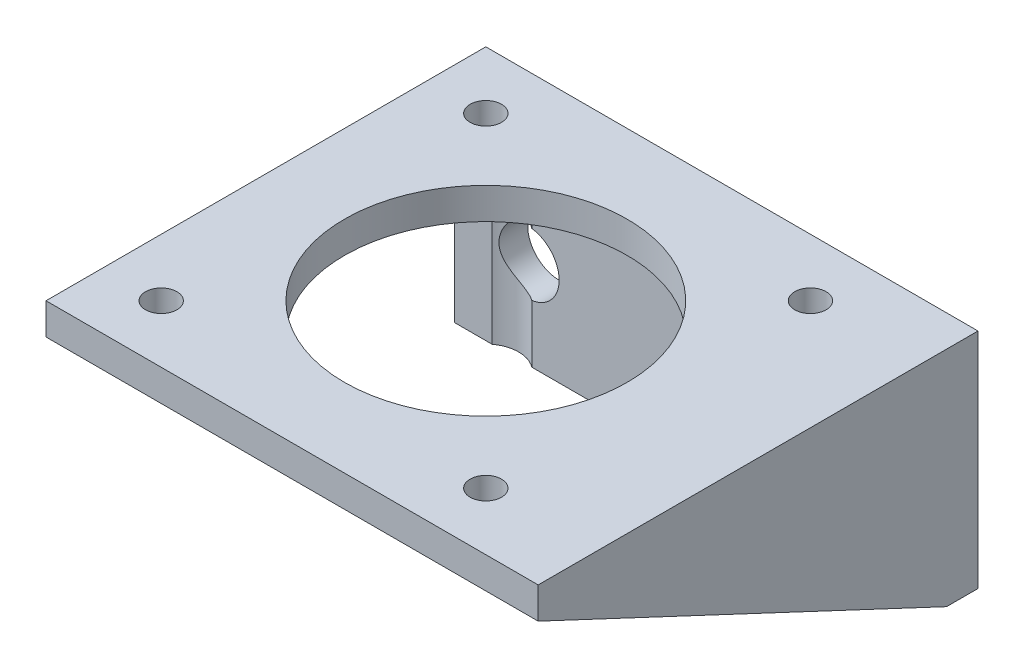
ISO-10303-21;
HEADER;
FILE_DESCRIPTION(('STEP AP214'),'2;1');
FILE_NAME('part.step','',(''),(''),'','','');
FILE_SCHEMA(('AUTOMOTIVE_DESIGN { 1 0 10303 214 1 1 1 1 }'));
ENDSEC;
DATA;
#1=APPLICATION_CONTEXT('core data for automotive mechanical design processes');
#2=APPLICATION_PROTOCOL_DEFINITION('international standard','automotive_design',2000,#1);
#3=PRODUCT_CONTEXT('',#1,'mechanical');
#4=PRODUCT('Part','Part','',(#3));
#5=PRODUCT_RELATED_PRODUCT_CATEGORY('part','',(#4));
#6=PRODUCT_DEFINITION_FORMATION('','',#4);
#7=PRODUCT_DEFINITION_CONTEXT('part definition',#1,'design');
#8=PRODUCT_DEFINITION('design','',#6,#7);
#9=PRODUCT_DEFINITION_SHAPE('','',#8);
#10=(LENGTH_UNIT() NAMED_UNIT(*) SI_UNIT(.MILLI.,.METRE.));
#11=(NAMED_UNIT(*) PLANE_ANGLE_UNIT() SI_UNIT($,.RADIAN.));
#12=(NAMED_UNIT(*) SI_UNIT($,.STERADIAN.) SOLID_ANGLE_UNIT());
#13=UNCERTAINTY_MEASURE_WITH_UNIT(LENGTH_MEASURE(1.E-05),#10,'distance_accuracy_value','');
#14=(GEOMETRIC_REPRESENTATION_CONTEXT(3) GLOBAL_UNCERTAINTY_ASSIGNED_CONTEXT((#13)) GLOBAL_UNIT_ASSIGNED_CONTEXT((#10,
#11,#12)) REPRESENTATION_CONTEXT('',''));
#15=CARTESIAN_POINT('',(0.,0.,0.));
#16=DIRECTION('',(0.,0.,1.));
#17=DIRECTION('',(1.,0.,0.));
#18=AXIS2_PLACEMENT_3D('',#15,#16,#17);
#19=CARTESIAN_POINT('',(77.1447839151503,157.565968794144,3.));
#20=DIRECTION('',(0.,1.,0.));
#21=DIRECTION('',(0.,0.,1.));
#22=AXIS2_PLACEMENT_3D('',#19,#20,#21);
#23=PLANE('',#22);
#24=CARTESIAN_POINT('',(113.64478391515,157.565968794144,5.50017920588967));
#25=DIRECTION('',(0.,1.,0.));
#26=DIRECTION('',(0.,0.,1.));
#27=AXIS2_PLACEMENT_3D('',#24,#25,#26);
#28=CIRCLE('',#27,3.13434940060138);
#29=CARTESIAN_POINT('',(111.754479679455,157.565968794144,3.));
#30=VERTEX_POINT('',#29);
#31=CARTESIAN_POINT('',(115.535088150845,157.565968794144,3.));
#32=VERTEX_POINT('',#31);
#33=EDGE_CURVE('E131',#30,#32,#28,.F.);
#34=ORIENTED_EDGE('',*,*,#33,.F.);
#35=DIRECTION('',(1.,0.,0.));
#36=VECTOR('',#35,1.);
#37=CARTESIAN_POINT('',(77.1447839151503,157.565968794144,3.));
#38=LINE('',#37,#36);
#39=CARTESIAN_POINT('',(84.5350881508455,157.565968794144,3.));
#40=VERTEX_POINT('',#39);
#41=EDGE_CURVE('E329',#40,#30,#38,.T.);
#42=ORIENTED_EDGE('',*,*,#41,.F.);
#43=CARTESIAN_POINT('',(82.6447839151503,157.565968794144,5.50017920588967));
#44=DIRECTION('',(0.,1.,0.));
#45=DIRECTION('',(0.,0.,1.));
#46=AXIS2_PLACEMENT_3D('',#43,#44,#45);
#47=CIRCLE('',#46,3.13434940060138);
#48=CARTESIAN_POINT('',(80.7544796794551,157.565968794144,3.));
#49=VERTEX_POINT('',#48);
#50=EDGE_CURVE('E233',#49,#40,#47,.F.);
#51=ORIENTED_EDGE('',*,*,#50,.F.);
#52=CARTESIAN_POINT('',(77.1447839151503,157.565968794144,3.));
#53=VERTEX_POINT('',#52);
#54=EDGE_CURVE('E332',#53,#49,#38,.T.);
#55=ORIENTED_EDGE('',*,*,#54,.F.);
#56=DIRECTION('',(0.,0.,-1.));
#57=VECTOR('',#56,1.);
#58=CARTESIAN_POINT('',(77.1447839151503,157.565968794144,3.));
#59=LINE('',#58,#57);
#60=CARTESIAN_POINT('',(77.1447839151503,157.565968794144,0.));
#61=VERTEX_POINT('',#60);
#62=EDGE_CURVE('E11',#53,#61,#59,.T.);
#63=ORIENTED_EDGE('',*,*,#62,.T.);
#64=DIRECTION('',(1.,0.,0.));
#65=VECTOR('',#64,1.);
#66=CARTESIAN_POINT('',(77.1447839151503,157.565968794144,0.));
#67=LINE('',#66,#65);
#68=CARTESIAN_POINT('',(124.14478391515,157.565968794144,0.));
#69=VERTEX_POINT('',#68);
#70=EDGE_CURVE('E342',#61,#69,#67,.T.);
#71=ORIENTED_EDGE('',*,*,#70,.T.);
#72=DIRECTION('',(0.,0.,-1.));
#73=VECTOR('',#72,1.);
#74=CARTESIAN_POINT('',(124.14478391515,157.565968794144,3.));
#75=LINE('',#74,#73);
#76=CARTESIAN_POINT('',(124.14478391515,157.565968794144,3.));
#77=VERTEX_POINT('',#76);
#78=EDGE_CURVE('E219',#77,#69,#75,.T.);
#79=ORIENTED_EDGE('',*,*,#78,.F.);
#80=DIRECTION('',(-1.,0.,0.));
#81=VECTOR('',#80,1.);
#82=CARTESIAN_POINT('',(124.14478391515,157.565968794144,3.));
#83=LINE('',#82,#81);
#84=CARTESIAN_POINT('',(119.14478391515,157.565968794144,3.));
#85=VERTEX_POINT('',#84);
#86=EDGE_CURVE('E212',#77,#85,#83,.T.);
#87=ORIENTED_EDGE('',*,*,#86,.T.);
#88=EDGE_CURVE('E330',#32,#85,#38,.T.);
#89=ORIENTED_EDGE('',*,*,#88,.F.);
#90=EDGE_LOOP('',(#34,#42,#51,#55,#63,#71,#79,#87,#89));
#91=FACE_BOUND('',#90,.T.);
#92=ADVANCED_FACE('F33',(#91),#23,.F.);
#93=CARTESIAN_POINT('',(77.1447839151503,178.865968794144,3.));
#94=DIRECTION('',(0.,0.,-1.));
#95=DIRECTION('',(-1.,0.,0.));
#96=AXIS2_PLACEMENT_3D('',#93,#94,#95);
#97=PLANE('',#96);
#98=DIRECTION('',(0.,1.,0.));
#99=VECTOR('',#98,1.);
#100=CARTESIAN_POINT('',(111.754479679455,155.865968794144,3.));
#101=LINE('',#100,#99);
#102=CARTESIAN_POINT('',(111.754479679455,175.865968794144,3.));
#103=VERTEX_POINT('',#102);
#104=CARTESIAN_POINT('',(111.754479679455,169.040470870727,3.));
#105=VERTEX_POINT('',#104);
#106=EDGE_CURVE('E48',#103,#105,#101,.F.);
#107=ORIENTED_EDGE('',*,*,#106,.F.);
#108=DIRECTION('',(-1.,0.,0.));
#109=VECTOR('',#108,1.);
#110=CARTESIAN_POINT('',(77.1447839151503,175.865968794144,3.));
#111=LINE('',#110,#109);
#112=CARTESIAN_POINT('',(84.5350881508455,175.865968794144,3.));
#113=VERTEX_POINT('',#112);
#114=EDGE_CURVE('E145',#103,#113,#111,.T.);
#115=ORIENTED_EDGE('',*,*,#114,.T.);
#116=DIRECTION('',(0.,1.,0.));
#117=VECTOR('',#116,1.);
#118=CARTESIAN_POINT('',(84.5350881508455,155.865968794144,3.));
#119=LINE('',#118,#117);
#120=CARTESIAN_POINT('',(84.5350881508455,169.040470870727,3.));
#121=VERTEX_POINT('',#120);
#122=EDGE_CURVE('E235',#121,#113,#119,.T.);
#123=ORIENTED_EDGE('',*,*,#122,.F.);
#124=CARTESIAN_POINT('',(84.1447839151503,166.065968794144,3.));
#125=DIRECTION('',(0.,0.,1.));
#126=DIRECTION('',(1.,0.,0.));
#127=AXIS2_PLACEMENT_3D('',#124,#125,#126);
#128=CIRCLE('',#127,3.00000000000001);
#129=CARTESIAN_POINT('',(84.5350881508455,163.09146671756,3.));
#130=VERTEX_POINT('',#129);
#131=EDGE_CURVE('E152',#130,#121,#128,.T.);
#132=ORIENTED_EDGE('',*,*,#131,.F.);
#133=EDGE_CURVE('E56',#40,#130,#119,.T.);
#134=ORIENTED_EDGE('',*,*,#133,.F.);
#135=ORIENTED_EDGE('',*,*,#41,.T.);
#136=CARTESIAN_POINT('',(111.754479679455,163.09146671756,3.));
#137=VERTEX_POINT('',#136);
#138=EDGE_CURVE('E321',#137,#30,#101,.F.);
#139=ORIENTED_EDGE('',*,*,#138,.F.);
#140=CARTESIAN_POINT('',(112.14478391515,166.065968794144,3.));
#141=DIRECTION('',(0.,0.,1.));
#142=DIRECTION('',(1.,0.,0.));
#143=AXIS2_PLACEMENT_3D('',#140,#141,#142);
#144=CIRCLE('',#143,3.00000000000001);
#145=EDGE_CURVE('E386',#105,#137,#144,.T.);
#146=ORIENTED_EDGE('',*,*,#145,.F.);
#147=EDGE_LOOP('',(#107,#115,#123,#132,#134,#135,#139,#146));
#148=FACE_BOUND('',#147,.T.);
#149=ADVANCED_FACE('F296',(#148),#97,.F.);
#150=DIRECTION('',(0.,1.,0.));
#151=VECTOR('',#150,1.);
#152=CARTESIAN_POINT('',(115.535088150845,155.865968794144,3.));
#153=LINE('',#152,#151);
#154=CARTESIAN_POINT('',(115.535088150845,175.865968794144,3.));
#155=VERTEX_POINT('',#154);
#156=EDGE_CURVE('E126',#32,#155,#153,.T.);
#157=ORIENTED_EDGE('',*,*,#156,.F.);
#158=ORIENTED_EDGE('',*,*,#88,.T.);
#159=DIRECTION('',(0.,1.,0.));
#160=VECTOR('',#159,1.);
#161=CARTESIAN_POINT('',(119.14478391515,157.565968794144,3.));
#162=LINE('',#161,#160);
#163=CARTESIAN_POINT('',(119.14478391515,175.865968794144,3.));
#164=VERTEX_POINT('',#163);
#165=EDGE_CURVE('E151',#85,#164,#162,.T.);
#166=ORIENTED_EDGE('',*,*,#165,.T.);
#167=EDGE_CURVE('E143',#164,#155,#111,.T.);
#168=ORIENTED_EDGE('',*,*,#167,.T.);
#169=EDGE_LOOP('',(#157,#158,#166,#168));
#170=FACE_BOUND('',#169,.T.);
#171=ADVANCED_FACE('F149',(#170),#97,.F.);
#172=CARTESIAN_POINT('',(112.14478391515,166.065968794144,0.));
#173=DIRECTION('',(0.,0.,1.));
#174=DIRECTION('',(1.,0.,0.));
#175=AXIS2_PLACEMENT_3D('',#172,#173,#174);
#176=CYLINDRICAL_SURFACE('',#175,3.00000000000001);
#177=CARTESIAN_POINT('',(112.14478391515,166.065968794144,0.));
#178=DIRECTION('',(0.,0.,1.));
#179=DIRECTION('',(1.,0.,0.));
#180=AXIS2_PLACEMENT_3D('',#177,#178,#179);
#181=CIRCLE('',#180,3.00000000000001);
#182=CARTESIAN_POINT('',(115.14478391515,166.065968794144,0.));
#183=VERTEX_POINT('',#182);
#184=EDGE_CURVE('E343',#183,#183,#181,.T.);
#185=ORIENTED_EDGE('',*,*,#184,.F.);
#186=EDGE_LOOP('',(#185));
#187=FACE_BOUND('',#186,.T.);
#188=CARTESIAN_POINT('',(111.754479679455,169.040470870727,3.));
#189=CARTESIAN_POINT('',(111.807241165498,169.047398750531,2.96009950952061));
#190=CARTESIAN_POINT('',(111.861392910043,169.053071317085,2.92179186020854));
#191=CARTESIAN_POINT('',(111.972209728457,169.061515830034,2.84856758024539));
#192=CARTESIAN_POINT('',(112.028876510419,169.064285772686,2.81365330718006));
#193=CARTESIAN_POINT('',(112.144491565869,169.06652651169,2.74741436383865));
#194=CARTESIAN_POINT('',(112.203443943069,169.065991072186,2.71609659203178));
#195=CARTESIAN_POINT('',(112.323077566866,169.061265769476,2.65734795097251));
#196=CARTESIAN_POINT('',(112.383758397043,169.057076779399,2.62991615486653));
#197=CARTESIAN_POINT('',(112.568293469794,169.038493022818,2.55348399757745));
#198=CARTESIAN_POINT('',(112.694211691861,169.018068332499,2.51059172224993));
#199=CARTESIAN_POINT('',(112.946338042062,168.959795009431,2.44184771531341));
#200=CARTESIAN_POINT('',(113.072545130703,168.921980327198,2.41596301784283));
#201=CARTESIAN_POINT('',(113.313752898231,168.83168087302,2.38111111928611));
#202=CARTESIAN_POINT('',(113.428984930558,168.780138908747,2.37127571495604));
#203=CARTESIAN_POINT('',(113.652380511964,168.662718198824,2.36384236019069));
#204=CARTESIAN_POINT('',(113.760536753154,168.596824925861,2.36625686551768));
#205=CARTESIAN_POINT('',(113.973417557881,168.447979464264,2.38117062313417));
#206=CARTESIAN_POINT('',(114.077545688311,168.364240304641,2.39426696601608));
#207=CARTESIAN_POINT('',(114.273119895231,168.184425150913,2.42785090056312));
#208=CARTESIAN_POINT('',(114.364561824964,168.088345142608,2.44834090115937));
#209=CARTESIAN_POINT('',(114.548132290552,167.868147199951,2.49707982313188));
#210=CARTESIAN_POINT('',(114.637688725855,167.742046745113,2.52605675051341));
#211=CARTESIAN_POINT('',(114.796518132387,167.477396188589,2.58387653723346));
#212=CARTESIAN_POINT('',(114.865770527551,167.338833642342,2.61271923161886));
#213=CARTESIAN_POINT('',(114.956412424969,167.115796584693,2.65324629721041));
#214=CARTESIAN_POINT('',(114.985388723487,167.034684129988,2.66685548386954));
#215=CARTESIAN_POINT('',(115.036337260104,166.869924582049,2.69152663529153));
#216=CARTESIAN_POINT('',(115.058312640323,166.786278644393,2.70258974215383));
#217=CARTESIAN_POINT('',(115.09498660488,166.617135998744,2.72142335739966));
#218=CARTESIAN_POINT('',(115.109693150865,166.531641423238,2.7291974669133));
#219=CARTESIAN_POINT('',(115.131655602582,166.359442951891,2.74091917376305));
#220=CARTESIAN_POINT('',(115.138912633582,166.272739240698,2.74486734901061));
#221=CARTESIAN_POINT('',(115.145534850417,166.1071602075,2.74846999118184));
#222=CARTESIAN_POINT('',(115.145580995801,166.028319371839,2.74849494842985));
#223=CARTESIAN_POINT('',(115.139472891832,165.870923272253,2.74517226569997));
#224=CARTESIAN_POINT('',(115.133316553268,165.792368113502,2.74182348933225));
#225=CARTESIAN_POINT('',(115.114879378002,165.636183979926,2.73195330083328));
#226=CARTESIAN_POINT('',(115.102598649711,165.558554988732,2.72543194486175));
#227=CARTESIAN_POINT('',(115.072062242318,165.404759622836,2.70960323413091));
#228=CARTESIAN_POINT('',(115.053804098635,165.328593865187,2.70029473032276));
#229=CARTESIAN_POINT('',(114.992014397557,165.109026939155,2.66977408813007));
#230=CARTESIAN_POINT('',(114.940677928397,164.968173938518,2.64548488747308));
#231=CARTESIAN_POINT('',(114.818028003355,164.696269268496,2.59293447094592));
#232=CARTESIAN_POINT('',(114.746698287858,164.565225687041,2.5646700315519));
#233=CARTESIAN_POINT('',(114.575145169646,164.299213063954,2.50554871520531));
#234=CARTESIAN_POINT('',(114.47241785415,164.165818554898,2.47481215810874));
#235=CARTESIAN_POINT('',(114.245091933422,163.917251269634,2.42164860289372));
#236=CARTESIAN_POINT('',(114.120516028573,163.802059814573,2.39921305465066));
#237=CARTESIAN_POINT('',(113.879697801667,163.614765311404,2.37279788837075));
#238=CARTESIAN_POINT('',(113.766882260508,163.538660935271,2.36599962165018));
#239=CARTESIAN_POINT('',(113.531951313608,163.402484827779,2.36566682956812));
#240=CARTESIAN_POINT('',(113.409845377408,163.342397045095,2.37211896817694));
#241=CARTESIAN_POINT('',(113.159607846537,163.239574517229,2.40103944937335));
#242=CARTESIAN_POINT('',(113.031451307497,163.196920174624,2.42358071244523));
#243=CARTESIAN_POINT('',(112.774585341323,163.129819542617,2.48615212522214));
#244=CARTESIAN_POINT('',(112.64587577091,163.105378298697,2.52618711625805));
#245=CARTESIAN_POINT('',(112.402489268516,163.074726743498,2.61979767973562));
#246=CARTESIAN_POINT('',(112.287482161332,163.067291381708,2.67213892861141));
#247=CARTESIAN_POINT('',(112.06469289274,163.064972850779,2.7903220127202));
#248=CARTESIAN_POINT('',(111.95690264721,163.070075386942,2.85614839484385));
#249=CARTESIAN_POINT('',(111.820209829674,163.083384617957,2.95130132977167));
#250=CARTESIAN_POINT('',(111.787071153835,163.087186012692,2.97535085666324));
#251=CARTESIAN_POINT('',(111.754479679455,163.09146671756,3.));
#252=B_SPLINE_CURVE_WITH_KNOTS('',3,(#188,#189,#190,#191,#192,#193,#194,#195,#196,#197,#198,
#199,#200,#201,#202,#203,#204,#205,#206,#207,#208,#209,#210,#211,#212,#213,#214,#215,#216,#217,
#218,#219,#220,#221,#222,#223,#224,#225,#226,#227,#228,#229,#230,#231,#232,#233,#234,#235,#236,
#237,#238,#239,#240,#241,#242,#243,#244,#245,#246,#247,#248,#249,#250,#251),.UNSPECIFIED.,.F.,
.F.,(4,2,2,2,2,2,2,2,2,2,2,2,2,2,2,2,2,2,2,2,2,2,2,2,2,2,2,2,2,2,2,4),(0.,0.199514071354091,
0.399165781034447,0.599194263914631,0.799174956892081,1.20059821554179,1.60124108024834,
1.97939083119544,2.35792516349336,2.75919853062522,3.16060275504447,3.63085226042168,
4.10157668123125,4.36288052878185,4.62406693335047,4.88496661960254,5.14582689053295,
5.38203637473139,5.61832544904167,5.85461034081138,6.0909927794645,6.54464602766998,
6.99866928763445,7.50972273437824,8.02024831566337,8.42732049032134,8.83398316309133,
9.24250074663651,9.65113145773541,10.0292491086296,10.4069358603642,10.530245763783),.UNSPECIFIED.);
#253=EDGE_CURVE('E146',#105,#137,#252,.T.);
#254=ORIENTED_EDGE('',*,*,#253,.F.);
#255=ORIENTED_EDGE('',*,*,#145,.T.);
#256=EDGE_LOOP('',(#254,#255));
#257=FACE_BOUND('',#256,.T.);
#258=ADVANCED_FACE('F312',(#187,#257),#176,.F.);
#259=DIRECTION('',(0.,1.,0.));
#260=VECTOR('',#259,1.);
#261=CARTESIAN_POINT('',(80.7544796794551,155.865968794144,3.));
#262=LINE('',#261,#260);
#263=CARTESIAN_POINT('',(80.7544796794551,175.865968794144,3.));
#264=VERTEX_POINT('',#263);
#265=EDGE_CURVE('E220',#264,#49,#262,.F.);
#266=ORIENTED_EDGE('',*,*,#265,.F.);
#267=CARTESIAN_POINT('',(77.1447839151503,175.865968794144,3.));
#268=VERTEX_POINT('',#267);
#269=EDGE_CURVE('E154',#264,#268,#111,.T.);
#270=ORIENTED_EDGE('',*,*,#269,.T.);
#271=DIRECTION('',(0.,-1.,0.));
#272=VECTOR('',#271,1.);
#273=CARTESIAN_POINT('',(77.1447839151503,157.565968794144,3.));
#274=LINE('',#273,#272);
#275=EDGE_CURVE('E335',#268,#53,#274,.T.);
#276=ORIENTED_EDGE('',*,*,#275,.T.);
#277=ORIENTED_EDGE('',*,*,#54,.T.);
#278=EDGE_LOOP('',(#266,#270,#276,#277));
#279=FACE_BOUND('',#278,.T.);
#280=ADVANCED_FACE('F304',(#279),#97,.F.);
#281=CARTESIAN_POINT('',(84.1447839151503,166.065968794144,0.));
#282=DIRECTION('',(0.,0.,1.));
#283=DIRECTION('',(1.,0.,0.));
#284=AXIS2_PLACEMENT_3D('',#281,#282,#283);
#285=CYLINDRICAL_SURFACE('',#284,3.00000000000001);
#286=CARTESIAN_POINT('',(84.1447839151503,166.065968794144,0.));
#287=DIRECTION('',(0.,0.,1.));
#288=DIRECTION('',(1.,0.,0.));
#289=AXIS2_PLACEMENT_3D('',#286,#287,#288);
#290=CIRCLE('',#289,3.00000000000001);
#291=CARTESIAN_POINT('',(87.1447839151503,166.065968794144,0.));
#292=VERTEX_POINT('',#291);
#293=EDGE_CURVE('E156',#292,#292,#290,.T.);
#294=ORIENTED_EDGE('',*,*,#293,.F.);
#295=EDGE_LOOP('',(#294));
#296=FACE_BOUND('',#295,.T.);
#297=CARTESIAN_POINT('',(84.5350881508455,163.09146671756,3.));
#298=CARTESIAN_POINT('',(84.4823266648026,163.084538837757,2.96009950952061));
#299=CARTESIAN_POINT('',(84.4281749202579,163.078866271203,2.92179186020854));
#300=CARTESIAN_POINT('',(84.317358101844,163.070421758253,2.84856758024539));
#301=CARTESIAN_POINT('',(84.2606913198816,163.067651815602,2.81365330718006));
#302=CARTESIAN_POINT('',(84.1450762644313,163.065411076597,2.74741436383865));
#303=CARTESIAN_POINT('',(84.0861238872312,163.065946516101,2.71609659203178));
#304=CARTESIAN_POINT('',(83.966490263435,163.070671818811,2.65734795097251));
#305=CARTESIAN_POINT('',(83.9058094332577,163.074860808889,2.62991615486653));
#306=CARTESIAN_POINT('',(83.721274360507,163.093444565469,2.55348399757745));
#307=CARTESIAN_POINT('',(83.5953561384393,163.113869255788,2.51059172224993));
#308=CARTESIAN_POINT('',(83.3432297882384,163.172142578856,2.44184771531341));
#309=CARTESIAN_POINT('',(83.2170226995973,163.209957261089,2.41596301784283));
#310=CARTESIAN_POINT('',(82.9758149320699,163.300256715267,2.38111111928611));
#311=CARTESIAN_POINT('',(82.8605828997426,163.351798679541,2.37127571495603));
#312=CARTESIAN_POINT('',(82.6371873183362,163.469219389464,2.36384236019069));
#313=CARTESIAN_POINT('',(82.5290310771467,163.535112662426,2.36625686551768));
#314=CARTESIAN_POINT('',(82.3161502724197,163.683958124023,2.38117062313417));
#315=CARTESIAN_POINT('',(82.2120221419892,163.767697283646,2.39426696601608));
#316=CARTESIAN_POINT('',(82.0164479350698,163.947512437374,2.42785090056312));
#317=CARTESIAN_POINT('',(81.9250060053365,164.043592445679,2.44834090115937));
#318=CARTESIAN_POINT('',(81.7414355397483,164.263790388336,2.49707982313189));
#319=CARTESIAN_POINT('',(81.6518791044454,164.389890843174,2.52605675051342));
#320=CARTESIAN_POINT('',(81.4930496979141,164.654541399698,2.58387653723346));
#321=CARTESIAN_POINT('',(81.4237973027495,164.793103945945,2.61271923161886));
#322=CARTESIAN_POINT('',(81.3331554053317,165.016141003594,2.65324629721042));
#323=CARTESIAN_POINT('',(81.3041791068138,165.097253458299,2.66685548386956));
#324=CARTESIAN_POINT('',(81.253230570197,165.262013006238,2.69152663529155));
#325=CARTESIAN_POINT('',(81.2312551899774,165.345658943894,2.70258974215384));
#326=CARTESIAN_POINT('',(81.1945812254203,165.514801589544,2.72142335739968));
#327=CARTESIAN_POINT('',(81.1798746794356,165.600296165049,2.72919746691332));
#328=CARTESIAN_POINT('',(81.1579122277184,165.772494636396,2.74091917376307));
#329=CARTESIAN_POINT('',(81.150655196719,165.859198347589,2.74486734901062));
#330=CARTESIAN_POINT('',(81.1440329798832,166.024777380787,2.74846999118186));
#331=CARTESIAN_POINT('',(81.1439868344994,166.103618216448,2.74849494842986));
#332=CARTESIAN_POINT('',(81.1500949384687,166.261014316034,2.74517226569999));
#333=CARTESIAN_POINT('',(81.1562512770324,166.339569474785,2.74182348933226));
#334=CARTESIAN_POINT('',(81.1746884522985,166.495753608361,2.73195330083329));
#335=CARTESIAN_POINT('',(81.1869691805895,166.573382599555,2.72543194486176));
#336=CARTESIAN_POINT('',(81.2175055879827,166.727177965451,2.70960323413092));
#337=CARTESIAN_POINT('',(81.2357637316659,166.803343723101,2.70029473032278));
#338=CARTESIAN_POINT('',(81.2975534327439,167.022910649132,2.66977408813009));
#339=CARTESIAN_POINT('',(81.3488899019039,167.163763649769,2.64548488747311));
#340=CARTESIAN_POINT('',(81.4715398269459,167.435668319791,2.59293447094594));
#341=CARTESIAN_POINT('',(81.5428695424428,167.566711901246,2.56467003155192));
#342=CARTESIAN_POINT('',(81.7144226606545,167.832724524333,2.50554871520532));
#343=CARTESIAN_POINT('',(81.8171499761507,167.966119033389,2.47481215810875));
#344=CARTESIAN_POINT('',(82.0444758968785,168.214686318653,2.42164860289373));
#345=CARTESIAN_POINT('',(82.169051801728,168.329877773714,2.39921305465067));
#346=CARTESIAN_POINT('',(82.4098700286332,168.517172276883,2.37279788837075));
#347=CARTESIAN_POINT('',(82.5226855697928,168.593276653016,2.36599962165018));
#348=CARTESIAN_POINT('',(82.7576165166923,168.729452760508,2.36566682956812));
#349=CARTESIAN_POINT('',(82.8797224528926,168.789540543192,2.37211896817694));
#350=CARTESIAN_POINT('',(83.1299599837631,168.892363071059,2.40103944937334));
#351=CARTESIAN_POINT('',(83.2581165228033,168.935017413663,2.42358071244523));
#352=CARTESIAN_POINT('',(83.5149824889773,169.00211804567,2.48615212522213));
#353=CARTESIAN_POINT('',(83.6436920593903,169.02655928959,2.52618711625804));
#354=CARTESIAN_POINT('',(83.8870785617844,169.057210844789,2.61979767973561));
#355=CARTESIAN_POINT('',(84.0020856689681,169.064646206579,2.6721389286114));
#356=CARTESIAN_POINT('',(84.2248749375606,169.066964737508,2.79032201272019));
#357=CARTESIAN_POINT('',(84.3326651830907,169.061862201345,2.85614839484384));
#358=CARTESIAN_POINT('',(84.4693580006267,169.04855297033,2.95130132977166));
#359=CARTESIAN_POINT('',(84.5024966764658,169.044751575596,2.97535085666324));
#360=CARTESIAN_POINT('',(84.5350881508455,169.040470870727,3.));
#361=B_SPLINE_CURVE_WITH_KNOTS('',3,(#297,#298,#299,#300,#301,#302,#303,#304,#305,#306,#307,
#308,#309,#310,#311,#312,#313,#314,#315,#316,#317,#318,#319,#320,#321,#322,#323,#324,#325,#326,
#327,#328,#329,#330,#331,#332,#333,#334,#335,#336,#337,#338,#339,#340,#341,#342,#343,#344,#345,
#346,#347,#348,#349,#350,#351,#352,#353,#354,#355,#356,#357,#358,#359,#360),.UNSPECIFIED.,.F.,
.F.,(4,2,2,2,2,2,2,2,2,2,2,2,2,2,2,2,2,2,2,2,2,2,2,2,2,2,2,2,2,2,2,4),(0.,0.199514071354091,
0.399165781034447,0.599194263914631,0.799174956892081,1.2005982155418,1.60124108024834,
1.97939083119547,2.35792516349335,2.75919853062522,3.16060275504446,3.63085226042168,
4.10157668123124,4.36288052878191,4.6240669333505,4.88496661960259,5.14582689053292,
5.38203637473136,5.6183254490417,5.8546103408114,6.09099277946449,6.54464602766994,
6.99866928763444,7.50972273437824,8.02024831566336,8.42732049032136,8.83398316309135,
9.24250074663654,9.65113145773543,10.0292491086297,10.4069358603643,10.530245763783),.UNSPECIFIED.);
#362=EDGE_CURVE('E238',#130,#121,#361,.T.);
#363=ORIENTED_EDGE('',*,*,#362,.F.);
#364=ORIENTED_EDGE('',*,*,#131,.T.);
#365=EDGE_LOOP('',(#363,#364));
#366=FACE_BOUND('',#365,.T.);
#367=ADVANCED_FACE('F245',(#296,#366),#285,.F.);
#368=CARTESIAN_POINT('',(77.1447839151503,157.565968794144,3.));
#369=DIRECTION('',(1.,0.,0.));
#370=DIRECTION('',(0.,0.,-1.));
#371=AXIS2_PLACEMENT_3D('',#368,#369,#370);
#372=PLANE('',#371);
#373=ORIENTED_EDGE('',*,*,#275,.F.);
#374=DIRECTION('',(0.,0.,1.));
#375=VECTOR('',#374,1.);
#376=CARTESIAN_POINT('',(77.1447839151503,175.865968794144,0.));
#377=LINE('',#376,#375);
#378=CARTESIAN_POINT('',(77.1447839151503,175.865968794144,42.));
#379=VERTEX_POINT('',#378);
#380=EDGE_CURVE('E172',#268,#379,#377,.T.);
#381=ORIENTED_EDGE('',*,*,#380,.T.);
#382=DIRECTION('',(0.,1.,0.));
#383=VECTOR('',#382,1.);
#384=CARTESIAN_POINT('',(77.1447839151503,175.865968794144,42.));
#385=LINE('',#384,#383);
#386=CARTESIAN_POINT('',(77.1447839151503,178.865968794144,42.));
#387=VERTEX_POINT('',#386);
#388=EDGE_CURVE('E160',#379,#387,#385,.T.);
#389=ORIENTED_EDGE('',*,*,#388,.T.);
#390=DIRECTION('',(0.,0.,-1.));
#391=VECTOR('',#390,1.);
#392=CARTESIAN_POINT('',(77.1447839151503,178.865968794144,3.));
#393=LINE('',#392,#391);
#394=CARTESIAN_POINT('',(77.1447839151503,178.865968794144,0.));
#395=VERTEX_POINT('',#394);
#396=EDGE_CURVE('E41',#387,#395,#393,.T.);
#397=ORIENTED_EDGE('',*,*,#396,.T.);
#398=DIRECTION('',(0.,-1.,0.));
#399=VECTOR('',#398,1.);
#400=CARTESIAN_POINT('',(77.1447839151503,157.565968794144,0.));
#401=LINE('',#400,#399);
#402=EDGE_CURVE('E340',#395,#61,#401,.T.);
#403=ORIENTED_EDGE('',*,*,#402,.T.);
#404=ORIENTED_EDGE('',*,*,#62,.F.);
#405=EDGE_LOOP('',(#373,#381,#389,#397,#403,#404));
#406=FACE_BOUND('',#405,.T.);
#407=ADVANCED_FACE('F35',(#406),#372,.F.);
#408=CARTESIAN_POINT('',(77.1447839151503,178.865968794144,3.));
#409=DIRECTION('',(0.,-1.,0.));
#410=DIRECTION('',(0.,0.,-1.));
#411=AXIS2_PLACEMENT_3D('',#408,#409,#410);
#412=PLANE('',#411);
#413=DIRECTION('',(-1.,0.,0.));
#414=VECTOR('',#413,1.);
#415=CARTESIAN_POINT('',(77.1447839151503,178.865968794144,0.));
#416=LINE('',#415,#414);
#417=CARTESIAN_POINT('',(124.14478391515,178.865968794144,0.));
#418=VERTEX_POINT('',#417);
#419=EDGE_CURVE('E345',#418,#395,#416,.T.);
#420=ORIENTED_EDGE('',*,*,#419,.T.);
#421=ORIENTED_EDGE('',*,*,#396,.F.);
#422=DIRECTION('',(1.,0.,0.));
#423=VECTOR('',#422,1.);
#424=CARTESIAN_POINT('',(119.14478391515,178.865968794144,42.));
#425=LINE('',#424,#423);
#426=CARTESIAN_POINT('',(124.14478391515,178.865968794144,42.));
#427=VERTEX_POINT('',#426);
#428=EDGE_CURVE('E175',#387,#427,#425,.T.);
#429=ORIENTED_EDGE('',*,*,#428,.T.);
#430=DIRECTION('',(0.,0.,1.));
#431=VECTOR('',#430,1.);
#432=CARTESIAN_POINT('',(124.14478391515,178.865968794144,0.));
#433=LINE('',#432,#431);
#434=EDGE_CURVE('E224',#418,#427,#433,.T.);
#435=ORIENTED_EDGE('',*,*,#434,.F.);
#436=EDGE_LOOP('',(#420,#421,#429,#435));
#437=FACE_BOUND('',#436,.T.);
#438=CARTESIAN_POINT('',(113.64478391515,178.865968794144,36.5001792058897));
#439=DIRECTION('',(0.,1.,0.));
#440=DIRECTION('',(0.,0.,1.));
#441=AXIS2_PLACEMENT_3D('',#438,#439,#440);
#442=CIRCLE('',#441,1.5);
#443=CARTESIAN_POINT('',(113.64478391515,178.865968794144,38.0001792058897));
#444=VERTEX_POINT('',#443);
#445=EDGE_CURVE('E181',#444,#444,#442,.T.);
#446=ORIENTED_EDGE('',*,*,#445,.F.);
#447=EDGE_LOOP('',(#446));
#448=FACE_BOUND('',#447,.T.);
#449=CARTESIAN_POINT('',(82.6447839151503,178.865968794144,36.5001792058897));
#450=DIRECTION('',(0.,1.,0.));
#451=DIRECTION('',(0.,0.,1.));
#452=AXIS2_PLACEMENT_3D('',#449,#450,#451);
#453=CIRCLE('',#452,1.5);
#454=CARTESIAN_POINT('',(82.6447839151503,178.865968794144,38.0001792058897));
#455=VERTEX_POINT('',#454);
#456=EDGE_CURVE('E187',#455,#455,#453,.T.);
#457=ORIENTED_EDGE('',*,*,#456,.F.);
#458=EDGE_LOOP('',(#457));
#459=FACE_BOUND('',#458,.T.);
#460=CARTESIAN_POINT('',(82.6447839151503,178.865968794144,5.50017920588968));
#461=DIRECTION('',(0.,1.,0.));
#462=DIRECTION('',(0.,0.,1.));
#463=AXIS2_PLACEMENT_3D('',#460,#461,#462);
#464=CIRCLE('',#463,1.5);
#465=CARTESIAN_POINT('',(82.6447839151503,178.865968794144,7.00017920588967));
#466=VERTEX_POINT('',#465);
#467=EDGE_CURVE('E193',#466,#466,#464,.T.);
#468=ORIENTED_EDGE('',*,*,#467,.F.);
#469=EDGE_LOOP('',(#468));
#470=FACE_BOUND('',#469,.T.);
#471=CARTESIAN_POINT('',(113.64478391515,178.865968794144,5.50017920588967));
#472=DIRECTION('',(0.,1.,0.));
#473=DIRECTION('',(0.,0.,1.));
#474=AXIS2_PLACEMENT_3D('',#471,#472,#473);
#475=CIRCLE('',#474,1.5);
#476=CARTESIAN_POINT('',(113.64478391515,178.865968794144,7.00017920588967));
#477=VERTEX_POINT('',#476);
#478=EDGE_CURVE('E199',#477,#477,#475,.T.);
#479=ORIENTED_EDGE('',*,*,#478,.F.);
#480=EDGE_LOOP('',(#479));
#481=FACE_BOUND('',#480,.T.);
#482=CARTESIAN_POINT('',(98.1447839151503,178.865968794144,21.0001792058896));
#483=DIRECTION('',(0.,1.,0.));
#484=DIRECTION('',(0.,0.,1.));
#485=AXIS2_PLACEMENT_3D('',#482,#483,#484);
#486=CIRCLE('',#485,13.5);
#487=CARTESIAN_POINT('',(98.1447839151503,178.865968794144,34.5001792058896));
#488=VERTEX_POINT('',#487);
#489=EDGE_CURVE('E205',#488,#488,#486,.T.);
#490=ORIENTED_EDGE('',*,*,#489,.F.);
#491=EDGE_LOOP('',(#490));
#492=FACE_BOUND('',#491,.T.);
#493=ADVANCED_FACE('F306',(#437,#448,#459,#470,#481,#492),#412,.F.);
#494=CARTESIAN_POINT('',(77.1447839151503,178.865968794144,0.));
#495=DIRECTION('',(0.,0.,-1.));
#496=DIRECTION('',(-1.,0.,0.));
#497=AXIS2_PLACEMENT_3D('',#494,#495,#496);
#498=PLANE('',#497);
#499=ORIENTED_EDGE('',*,*,#70,.F.);
#500=ORIENTED_EDGE('',*,*,#402,.F.);
#501=ORIENTED_EDGE('',*,*,#419,.F.);
#502=DIRECTION('',(0.,1.,0.));
#503=VECTOR('',#502,1.);
#504=CARTESIAN_POINT('',(124.14478391515,157.565968794144,0.));
#505=LINE('',#504,#503);
#506=EDGE_CURVE('E227',#69,#418,#505,.T.);
#507=ORIENTED_EDGE('',*,*,#506,.F.);
#508=EDGE_LOOP('',(#499,#500,#501,#507));
#509=FACE_BOUND('',#508,.T.);
#510=ORIENTED_EDGE('',*,*,#293,.T.);
#511=EDGE_LOOP('',(#510));
#512=FACE_BOUND('',#511,.T.);
#513=ORIENTED_EDGE('',*,*,#184,.T.);
#514=EDGE_LOOP('',(#513));
#515=FACE_BOUND('',#514,.T.);
#516=ADVANCED_FACE('F289',(#509,#512,#515),#498,.T.);
#517=CARTESIAN_POINT('',(119.14478391515,175.865968794144,42.));
#518=DIRECTION('',(0.,-1.,0.));
#519=DIRECTION('',(0.,0.,-1.));
#520=AXIS2_PLACEMENT_3D('',#517,#518,#519);
#521=PLANE('',#520);
#522=ORIENTED_EDGE('',*,*,#114,.F.);
#523=CARTESIAN_POINT('',(113.64478391515,175.865968794144,5.50017920588967));
#524=DIRECTION('',(0.,-1.,0.));
#525=DIRECTION('',(0.,0.,-1.));
#526=AXIS2_PLACEMENT_3D('',#523,#524,#525);
#527=CIRCLE('',#526,3.13434940060138);
#528=EDGE_CURVE('E129',#103,#155,#527,.T.);
#529=ORIENTED_EDGE('',*,*,#528,.T.);
#530=ORIENTED_EDGE('',*,*,#167,.F.);
#531=DIRECTION('',(0.,0.,-1.));
#532=VECTOR('',#531,1.);
#533=CARTESIAN_POINT('',(119.14478391515,175.865968794144,0.));
#534=LINE('',#533,#532);
#535=CARTESIAN_POINT('',(119.14478391515,175.865968794144,42.));
#536=VERTEX_POINT('',#535);
#537=EDGE_CURVE('E176',#536,#164,#534,.T.);
#538=ORIENTED_EDGE('',*,*,#537,.F.);
#539=DIRECTION('',(1.,0.,0.));
#540=VECTOR('',#539,1.);
#541=CARTESIAN_POINT('',(119.14478391515,175.865968794144,42.));
#542=LINE('',#541,#540);
#543=EDGE_CURVE('E166',#379,#536,#542,.T.);
#544=ORIENTED_EDGE('',*,*,#543,.F.);
#545=ORIENTED_EDGE('',*,*,#380,.F.);
#546=ORIENTED_EDGE('',*,*,#269,.F.);
#547=CARTESIAN_POINT('',(82.6447839151503,175.865968794144,5.50017920588967));
#548=DIRECTION('',(0.,-1.,0.));
#549=DIRECTION('',(0.,0.,-1.));
#550=AXIS2_PLACEMENT_3D('',#547,#548,#549);
#551=CIRCLE('',#550,3.13434940060138);
#552=EDGE_CURVE('E135',#264,#113,#551,.T.);
#553=ORIENTED_EDGE('',*,*,#552,.T.);
#554=EDGE_LOOP('',(#522,#529,#530,#538,#544,#545,#546,#553));
#555=FACE_BOUND('',#554,.T.);
#556=CARTESIAN_POINT('',(113.64478391515,175.865968794144,5.50017920588967));
#557=DIRECTION('',(0.,1.,0.));
#558=DIRECTION('',(0.,0.,1.));
#559=AXIS2_PLACEMENT_3D('',#556,#557,#558);
#560=CIRCLE('',#559,1.5);
#561=CARTESIAN_POINT('',(113.64478391515,175.865968794144,7.00017920588967));
#562=VERTEX_POINT('',#561);
#563=EDGE_CURVE('E196',#562,#562,#560,.T.);
#564=ORIENTED_EDGE('',*,*,#563,.T.);
#565=EDGE_LOOP('',(#564));
#566=FACE_BOUND('',#565,.T.);
#567=CARTESIAN_POINT('',(113.64478391515,175.865968794144,36.5001792058897));
#568=DIRECTION('',(0.,1.,0.));
#569=DIRECTION('',(0.,0.,1.));
#570=AXIS2_PLACEMENT_3D('',#567,#568,#569);
#571=CIRCLE('',#570,1.5);
#572=CARTESIAN_POINT('',(113.64478391515,175.865968794144,38.0001792058897));
#573=VERTEX_POINT('',#572);
#574=EDGE_CURVE('E177',#573,#573,#571,.T.);
#575=ORIENTED_EDGE('',*,*,#574,.T.);
#576=EDGE_LOOP('',(#575));
#577=FACE_BOUND('',#576,.T.);
#578=CARTESIAN_POINT('',(82.6447839151503,175.865968794144,36.5001792058897));
#579=DIRECTION('',(0.,1.,0.));
#580=DIRECTION('',(0.,0.,1.));
#581=AXIS2_PLACEMENT_3D('',#578,#579,#580);
#582=CIRCLE('',#581,1.5);
#583=CARTESIAN_POINT('',(82.6447839151503,175.865968794144,38.0001792058897));
#584=VERTEX_POINT('',#583);
#585=EDGE_CURVE('E184',#584,#584,#582,.T.);
#586=ORIENTED_EDGE('',*,*,#585,.T.);
#587=EDGE_LOOP('',(#586));
#588=FACE_BOUND('',#587,.T.);
#589=CARTESIAN_POINT('',(98.1447839151503,175.865968794144,21.0001792058896));
#590=DIRECTION('',(0.,1.,0.));
#591=DIRECTION('',(0.,0.,1.));
#592=AXIS2_PLACEMENT_3D('',#589,#590,#591);
#593=CIRCLE('',#592,13.5);
#594=CARTESIAN_POINT('',(98.1447839151503,175.865968794144,34.5001792058896));
#595=VERTEX_POINT('',#594);
#596=EDGE_CURVE('E202',#595,#595,#593,.T.);
#597=ORIENTED_EDGE('',*,*,#596,.T.);
#598=EDGE_LOOP('',(#597));
#599=FACE_BOUND('',#598,.T.);
#600=CARTESIAN_POINT('',(82.6447839151503,175.865968794144,5.50017920588968));
#601=DIRECTION('',(0.,1.,0.));
#602=DIRECTION('',(0.,0.,1.));
#603=AXIS2_PLACEMENT_3D('',#600,#601,#602);
#604=CIRCLE('',#603,1.5);
#605=CARTESIAN_POINT('',(82.6447839151503,175.865968794144,7.00017920588967));
#606=VERTEX_POINT('',#605);
#607=EDGE_CURVE('E190',#606,#606,#604,.T.);
#608=ORIENTED_EDGE('',*,*,#607,.T.);
#609=EDGE_LOOP('',(#608));
#610=FACE_BOUND('',#609,.T.);
#611=ADVANCED_FACE('F140',(#555,#566,#577,#588,#599,#610),#521,.T.);
#612=CARTESIAN_POINT('',(119.14478391515,175.865968794144,42.));
#613=DIRECTION('',(0.,0.,1.));
#614=DIRECTION('',(1.,0.,0.));
#615=AXIS2_PLACEMENT_3D('',#612,#613,#614);
#616=PLANE('',#615);
#617=ORIENTED_EDGE('',*,*,#428,.F.);
#618=ORIENTED_EDGE('',*,*,#388,.F.);
#619=ORIENTED_EDGE('',*,*,#543,.T.);
#620=DIRECTION('',(-1.,0.,0.));
#621=VECTOR('',#620,1.);
#622=CARTESIAN_POINT('',(124.14478391515,175.865968794144,42.));
#623=LINE('',#622,#621);
#624=CARTESIAN_POINT('',(124.14478391515,175.865968794144,42.));
#625=VERTEX_POINT('',#624);
#626=EDGE_CURVE('E208',#625,#536,#623,.T.);
#627=ORIENTED_EDGE('',*,*,#626,.F.);
#628=DIRECTION('',(0.,-1.,0.));
#629=VECTOR('',#628,1.);
#630=CARTESIAN_POINT('',(124.14478391515,178.865968794144,42.));
#631=LINE('',#630,#629);
#632=EDGE_CURVE('E222',#427,#625,#631,.T.);
#633=ORIENTED_EDGE('',*,*,#632,.F.);
#634=EDGE_LOOP('',(#617,#618,#619,#627,#633));
#635=FACE_BOUND('',#634,.T.);
#636=ADVANCED_FACE('F286',(#635),#616,.T.);
#637=CARTESIAN_POINT('',(113.64478391515,175.865968794144,36.5001792058897));
#638=DIRECTION('',(0.,1.,0.));
#639=DIRECTION('',(0.,0.,1.));
#640=AXIS2_PLACEMENT_3D('',#637,#638,#639);
#641=CYLINDRICAL_SURFACE('',#640,1.5);
#642=ORIENTED_EDGE('',*,*,#574,.F.);
#643=EDGE_LOOP('',(#642));
#644=FACE_BOUND('',#643,.T.);
#645=ORIENTED_EDGE('',*,*,#445,.T.);
#646=EDGE_LOOP('',(#645));
#647=FACE_BOUND('',#646,.T.);
#648=ADVANCED_FACE('F282',(#644,#647),#641,.F.);
#649=CARTESIAN_POINT('',(82.6447839151503,175.865968794144,36.5001792058897));
#650=DIRECTION('',(0.,1.,0.));
#651=DIRECTION('',(0.,0.,1.));
#652=AXIS2_PLACEMENT_3D('',#649,#650,#651);
#653=CYLINDRICAL_SURFACE('',#652,1.5);
#654=ORIENTED_EDGE('',*,*,#585,.F.);
#655=EDGE_LOOP('',(#654));
#656=FACE_BOUND('',#655,.T.);
#657=ORIENTED_EDGE('',*,*,#456,.T.);
#658=EDGE_LOOP('',(#657));
#659=FACE_BOUND('',#658,.T.);
#660=ADVANCED_FACE('F278',(#656,#659),#653,.F.);
#661=CARTESIAN_POINT('',(82.6447839151503,175.865968794144,5.50017920588968));
#662=DIRECTION('',(0.,1.,0.));
#663=DIRECTION('',(0.,0.,1.));
#664=AXIS2_PLACEMENT_3D('',#661,#662,#663);
#665=CYLINDRICAL_SURFACE('',#664,1.5);
#666=ORIENTED_EDGE('',*,*,#607,.F.);
#667=EDGE_LOOP('',(#666));
#668=FACE_BOUND('',#667,.T.);
#669=ORIENTED_EDGE('',*,*,#467,.T.);
#670=EDGE_LOOP('',(#669));
#671=FACE_BOUND('',#670,.T.);
#672=ADVANCED_FACE('F274',(#668,#671),#665,.F.);
#673=CARTESIAN_POINT('',(113.64478391515,175.865968794144,5.50017920588967));
#674=DIRECTION('',(0.,1.,0.));
#675=DIRECTION('',(0.,0.,1.));
#676=AXIS2_PLACEMENT_3D('',#673,#674,#675);
#677=CYLINDRICAL_SURFACE('',#676,1.5);
#678=ORIENTED_EDGE('',*,*,#563,.F.);
#679=EDGE_LOOP('',(#678));
#680=FACE_BOUND('',#679,.T.);
#681=ORIENTED_EDGE('',*,*,#478,.T.);
#682=EDGE_LOOP('',(#681));
#683=FACE_BOUND('',#682,.T.);
#684=ADVANCED_FACE('F270',(#680,#683),#677,.F.);
#685=CARTESIAN_POINT('',(98.1447839151503,175.865968794144,21.0001792058896));
#686=DIRECTION('',(0.,1.,0.));
#687=DIRECTION('',(0.,0.,1.));
#688=AXIS2_PLACEMENT_3D('',#685,#686,#687);
#689=CYLINDRICAL_SURFACE('',#688,13.5);
#690=ORIENTED_EDGE('',*,*,#596,.F.);
#691=EDGE_LOOP('',(#690));
#692=FACE_BOUND('',#691,.T.);
#693=ORIENTED_EDGE('',*,*,#489,.T.);
#694=EDGE_LOOP('',(#693));
#695=FACE_BOUND('',#694,.T.);
#696=ADVANCED_FACE('F263',(#692,#695),#689,.F.);
#697=CARTESIAN_POINT('',(119.14478391515,157.565968794144,0.));
#698=DIRECTION('',(1.,0.,0.));
#699=DIRECTION('',(0.,0.,-1.));
#700=AXIS2_PLACEMENT_3D('',#697,#698,#699);
#701=PLANE('',#700);
#702=DIRECTION('',(0.,-0.424790674352243,-0.905291601078551));
#703=VECTOR('',#702,1.);
#704=CARTESIAN_POINT('',(119.14478391515,175.865968794144,42.));
#705=LINE('',#704,#703);
#706=EDGE_CURVE('E216',#536,#85,#705,.T.);
#707=ORIENTED_EDGE('',*,*,#706,.F.);
#708=ORIENTED_EDGE('',*,*,#537,.T.);
#709=ORIENTED_EDGE('',*,*,#165,.F.);
#710=EDGE_LOOP('',(#707,#708,#709));
#711=FACE_BOUND('',#710,.T.);
#712=ADVANCED_FACE('F260',(#711),#701,.F.);
#713=CARTESIAN_POINT('',(124.14478391515,175.865968794144,42.));
#714=DIRECTION('',(0.,0.905291601078551,-0.424790674352243));
#715=DIRECTION('',(0.,0.424790674352243,0.905291601078551));
#716=AXIS2_PLACEMENT_3D('',#713,#714,#715);
#717=PLANE('',#716);
#718=ORIENTED_EDGE('',*,*,#706,.T.);
#719=ORIENTED_EDGE('',*,*,#86,.F.);
#720=DIRECTION('',(0.,-0.424790674352243,-0.905291601078551));
#721=VECTOR('',#720,1.);
#722=CARTESIAN_POINT('',(124.14478391515,175.865968794144,42.));
#723=LINE('',#722,#721);
#724=EDGE_CURVE('E215',#625,#77,#723,.T.);
#725=ORIENTED_EDGE('',*,*,#724,.F.);
#726=ORIENTED_EDGE('',*,*,#626,.T.);
#727=EDGE_LOOP('',(#718,#719,#725,#726));
#728=FACE_BOUND('',#727,.T.);
#729=ADVANCED_FACE('F258',(#728),#717,.F.);
#730=CARTESIAN_POINT('',(124.14478391515,157.565968794144,0.));
#731=DIRECTION('',(1.,0.,0.));
#732=DIRECTION('',(0.,0.,-1.));
#733=AXIS2_PLACEMENT_3D('',#730,#731,#732);
#734=PLANE('',#733);
#735=ORIENTED_EDGE('',*,*,#78,.T.);
#736=ORIENTED_EDGE('',*,*,#506,.T.);
#737=ORIENTED_EDGE('',*,*,#434,.T.);
#738=ORIENTED_EDGE('',*,*,#632,.T.);
#739=ORIENTED_EDGE('',*,*,#724,.T.);
#740=EDGE_LOOP('',(#735,#736,#737,#738,#739));
#741=FACE_BOUND('',#740,.T.);
#742=ADVANCED_FACE('F254',(#741),#734,.T.);
#743=CARTESIAN_POINT('',(82.6447839151503,155.865968794144,5.50017920588967));
#744=DIRECTION('',(0.,1.,0.));
#745=DIRECTION('',(0.,0.,1.));
#746=AXIS2_PLACEMENT_3D('',#743,#744,#745);
#747=CYLINDRICAL_SURFACE('',#746,3.13434940060138);
#748=ORIENTED_EDGE('',*,*,#265,.T.);
#749=ORIENTED_EDGE('',*,*,#50,.T.);
#750=ORIENTED_EDGE('',*,*,#133,.T.);
#751=ORIENTED_EDGE('',*,*,#362,.T.);
#752=ORIENTED_EDGE('',*,*,#122,.T.);
#753=ORIENTED_EDGE('',*,*,#552,.F.);
#754=EDGE_LOOP('',(#748,#749,#750,#751,#752,#753));
#755=FACE_BOUND('',#754,.T.);
#756=ADVANCED_FACE('F249',(#755),#747,.F.);
#757=CARTESIAN_POINT('',(113.64478391515,155.865968794144,5.50017920588967));
#758=DIRECTION('',(0.,1.,0.));
#759=DIRECTION('',(0.,0.,1.));
#760=AXIS2_PLACEMENT_3D('',#757,#758,#759);
#761=CYLINDRICAL_SURFACE('',#760,3.13434940060138);
#762=ORIENTED_EDGE('',*,*,#156,.T.);
#763=ORIENTED_EDGE('',*,*,#528,.F.);
#764=ORIENTED_EDGE('',*,*,#106,.T.);
#765=ORIENTED_EDGE('',*,*,#253,.T.);
#766=ORIENTED_EDGE('',*,*,#138,.T.);
#767=ORIENTED_EDGE('',*,*,#33,.T.);
#768=EDGE_LOOP('',(#762,#763,#764,#765,#766,#767));
#769=FACE_BOUND('',#768,.T.);
#770=ADVANCED_FACE('F128',(#769),#761,.F.);
#771=CLOSED_SHELL('',(#92,#149,#171,#258,#280,#367,#407,#493,#516,#611,#636,#648,#660,#672,#684,
#696,#712,#729,#742,#756,#770));
#772=MANIFOLD_SOLID_BREP('B2',#771);
#773=ADVANCED_BREP_SHAPE_REPRESENTATION('',(#18,#772),#14);
#774=SHAPE_DEFINITION_REPRESENTATION(#9,#773);
ENDSEC;
END-ISO-10303-21;
